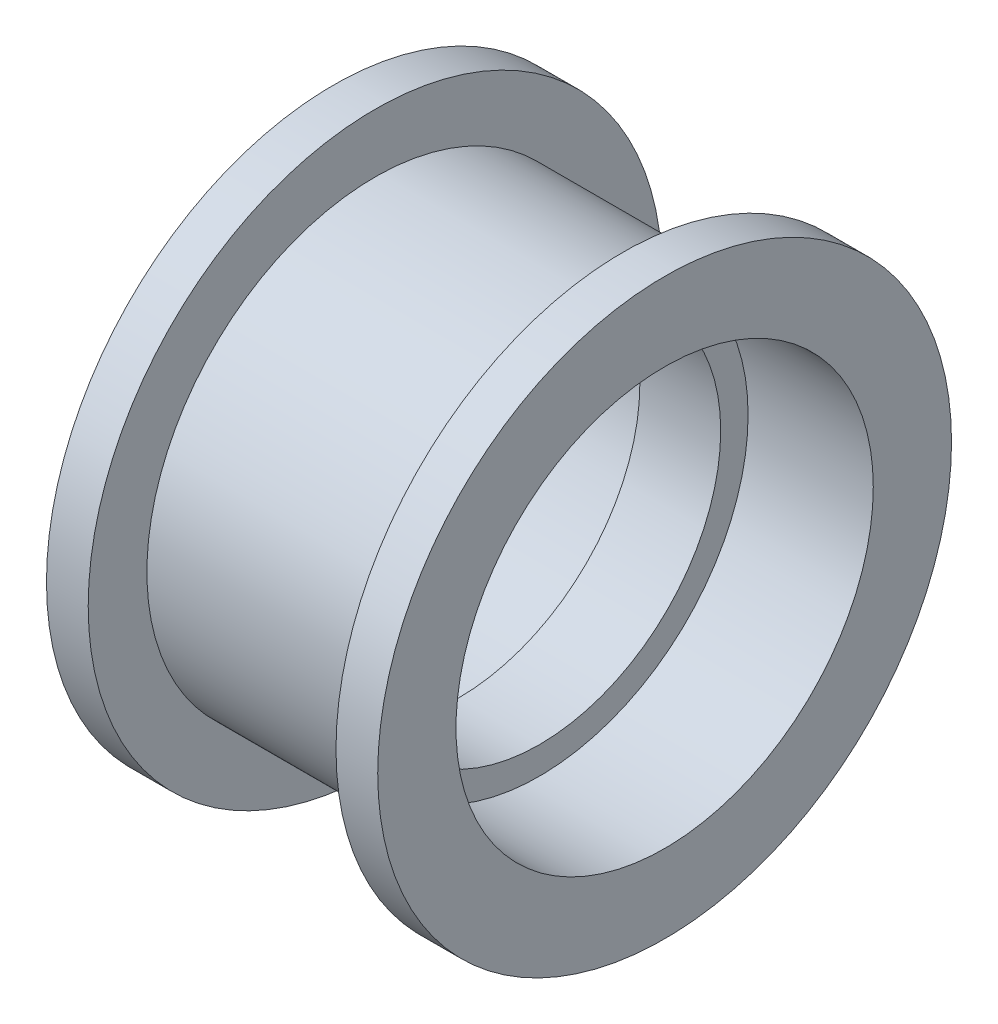
ISO-10303-21;
HEADER;
FILE_DESCRIPTION(('STEP AP214'),'2;1');
FILE_NAME('part.step','',(''),(''),'','','');
FILE_SCHEMA(('AUTOMOTIVE_DESIGN { 1 0 10303 214 1 1 1 1 }'));
ENDSEC;
DATA;
#1=APPLICATION_CONTEXT('core data for automotive mechanical design processes');
#2=APPLICATION_PROTOCOL_DEFINITION('international standard','automotive_design',2000,#1);
#3=PRODUCT_CONTEXT('',#1,'mechanical');
#4=PRODUCT('Part','Part','',(#3));
#5=PRODUCT_RELATED_PRODUCT_CATEGORY('part','',(#4));
#6=PRODUCT_DEFINITION_FORMATION('','',#4);
#7=PRODUCT_DEFINITION_CONTEXT('part definition',#1,'design');
#8=PRODUCT_DEFINITION('design','',#6,#7);
#9=PRODUCT_DEFINITION_SHAPE('','',#8);
#10=(LENGTH_UNIT() NAMED_UNIT(*) SI_UNIT(.MILLI.,.METRE.));
#11=(NAMED_UNIT(*) PLANE_ANGLE_UNIT() SI_UNIT($,.RADIAN.));
#12=(NAMED_UNIT(*) SI_UNIT($,.STERADIAN.) SOLID_ANGLE_UNIT());
#13=UNCERTAINTY_MEASURE_WITH_UNIT(LENGTH_MEASURE(1.E-05),#10,'distance_accuracy_value','');
#14=(GEOMETRIC_REPRESENTATION_CONTEXT(3) GLOBAL_UNCERTAINTY_ASSIGNED_CONTEXT((#13)) GLOBAL_UNIT_ASSIGNED_CONTEXT((#10,
#11,#12)) REPRESENTATION_CONTEXT('',''));
#15=CARTESIAN_POINT('',(0.,0.,0.));
#16=DIRECTION('',(0.,0.,1.));
#17=DIRECTION('',(1.,0.,0.));
#18=AXIS2_PLACEMENT_3D('',#15,#16,#17);
#19=CARTESIAN_POINT('',(-1.55,6.95,0.));
#20=DIRECTION('',(-1.,0.,0.));
#21=DIRECTION('',(0.,0.,1.));
#22=AXIS2_PLACEMENT_3D('',#19,#20,#21);
#23=PLANE('',#22);
#24=CARTESIAN_POINT('',(-1.55,0.,0.));
#25=DIRECTION('',(1.,0.,0.));
#26=DIRECTION('',(0.,0.,-1.));
#27=AXIS2_PLACEMENT_3D('',#24,#25,#26);
#28=CIRCLE('',#27,6.95);
#29=CARTESIAN_POINT('',(-1.55,0.,-6.95));
#30=VERTEX_POINT('',#29);
#31=EDGE_CURVE('E12',#30,#30,#28,.T.);
#32=ORIENTED_EDGE('',*,*,#31,.T.);
#33=EDGE_LOOP('',(#32));
#34=FACE_BOUND('',#33,.T.);
#35=CARTESIAN_POINT('',(-1.55,0.,0.));
#36=DIRECTION('',(1.,0.,0.));
#37=DIRECTION('',(0.,0.,-1.));
#38=AXIS2_PLACEMENT_3D('',#35,#36,#37);
#39=CIRCLE('',#38,8.);
#40=CARTESIAN_POINT('',(-1.55,0.,-8.));
#41=VERTEX_POINT('',#40);
#42=EDGE_CURVE('E87',#41,#41,#39,.T.);
#43=ORIENTED_EDGE('',*,*,#42,.F.);
#44=EDGE_LOOP('',(#43));
#45=FACE_BOUND('',#44,.T.);
#46=ADVANCED_FACE('F47',(#34,#45),#23,.T.);
#47=CARTESIAN_POINT('',(0.,0.,0.));
#48=DIRECTION('',(1.,0.,0.));
#49=DIRECTION('',(0.,0.,-1.));
#50=AXIS2_PLACEMENT_3D('',#47,#48,#49);
#51=CYLINDRICAL_SURFACE('',#50,6.95);
#52=CARTESIAN_POINT('',(1.55,0.,0.));
#53=DIRECTION('',(1.,0.,0.));
#54=DIRECTION('',(0.,0.,-1.));
#55=AXIS2_PLACEMENT_3D('',#52,#53,#54);
#56=CIRCLE('',#55,6.95);
#57=CARTESIAN_POINT('',(1.55,0.,-6.95));
#58=VERTEX_POINT('',#57);
#59=EDGE_CURVE('E53',#58,#58,#56,.T.);
#60=ORIENTED_EDGE('',*,*,#59,.T.);
#61=EDGE_LOOP('',(#60));
#62=FACE_BOUND('',#61,.T.);
#63=ORIENTED_EDGE('',*,*,#31,.F.);
#64=EDGE_LOOP('',(#63));
#65=FACE_BOUND('',#64,.T.);
#66=ADVANCED_FACE('F95',(#62,#65),#51,.F.);
#67=CARTESIAN_POINT('',(1.55,6.95,0.));
#68=DIRECTION('',(1.,0.,0.));
#69=DIRECTION('',(0.,0.,-1.));
#70=AXIS2_PLACEMENT_3D('',#67,#68,#69);
#71=PLANE('',#70);
#72=CARTESIAN_POINT('',(1.55,0.,0.));
#73=DIRECTION('',(1.,0.,0.));
#74=DIRECTION('',(0.,0.,-1.));
#75=AXIS2_PLACEMENT_3D('',#72,#73,#74);
#76=CIRCLE('',#75,8.);
#77=CARTESIAN_POINT('',(1.55,0.,-8.));
#78=VERTEX_POINT('',#77);
#79=EDGE_CURVE('E57',#78,#78,#76,.T.);
#80=ORIENTED_EDGE('',*,*,#79,.T.);
#81=EDGE_LOOP('',(#80));
#82=FACE_BOUND('',#81,.T.);
#83=ORIENTED_EDGE('',*,*,#59,.F.);
#84=EDGE_LOOP('',(#83));
#85=FACE_BOUND('',#84,.T.);
#86=ADVANCED_FACE('F99',(#82,#85),#71,.T.);
#87=CARTESIAN_POINT('',(0.,0.,0.));
#88=DIRECTION('',(1.,0.,0.));
#89=DIRECTION('',(0.,0.,-1.));
#90=AXIS2_PLACEMENT_3D('',#87,#88,#89);
#91=CYLINDRICAL_SURFACE('',#90,8.);
#92=CARTESIAN_POINT('',(6.35,0.,0.));
#93=DIRECTION('',(1.,0.,0.));
#94=DIRECTION('',(0.,0.,-1.));
#95=AXIS2_PLACEMENT_3D('',#92,#93,#94);
#96=CIRCLE('',#95,8.);
#97=CARTESIAN_POINT('',(6.35,0.,-8.));
#98=VERTEX_POINT('',#97);
#99=EDGE_CURVE('E61',#98,#98,#96,.T.);
#100=ORIENTED_EDGE('',*,*,#99,.T.);
#101=EDGE_LOOP('',(#100));
#102=FACE_BOUND('',#101,.T.);
#103=ORIENTED_EDGE('',*,*,#79,.F.);
#104=EDGE_LOOP('',(#103));
#105=FACE_BOUND('',#104,.T.);
#106=ADVANCED_FACE('F103',(#102,#105),#91,.F.);
#107=CARTESIAN_POINT('',(6.35,8.,0.));
#108=DIRECTION('',(1.,0.,0.));
#109=DIRECTION('',(0.,0.,-1.));
#110=AXIS2_PLACEMENT_3D('',#107,#108,#109);
#111=PLANE('',#110);
#112=CARTESIAN_POINT('',(6.35,0.,0.));
#113=DIRECTION('',(1.,0.,0.));
#114=DIRECTION('',(0.,0.,-1.));
#115=AXIS2_PLACEMENT_3D('',#112,#113,#114);
#116=CIRCLE('',#115,11.);
#117=CARTESIAN_POINT('',(6.35,0.,-11.));
#118=VERTEX_POINT('',#117);
#119=EDGE_CURVE('E66',#118,#118,#116,.T.);
#120=ORIENTED_EDGE('',*,*,#119,.T.);
#121=EDGE_LOOP('',(#120));
#122=FACE_BOUND('',#121,.T.);
#123=ORIENTED_EDGE('',*,*,#99,.F.);
#124=EDGE_LOOP('',(#123));
#125=FACE_BOUND('',#124,.T.);
#126=ADVANCED_FACE('F110',(#122,#125),#111,.T.);
#127=CARTESIAN_POINT('',(0.,0.,0.));
#128=DIRECTION('',(1.,0.,0.));
#129=DIRECTION('',(0.,0.,-1.));
#130=AXIS2_PLACEMENT_3D('',#127,#128,#129);
#131=CYLINDRICAL_SURFACE('',#130,11.);
#132=CARTESIAN_POINT('',(4.75,0.,0.));
#133=DIRECTION('',(1.,0.,0.));
#134=DIRECTION('',(0.,0.,-1.));
#135=AXIS2_PLACEMENT_3D('',#132,#133,#134);
#136=CIRCLE('',#135,11.);
#137=CARTESIAN_POINT('',(4.75,0.,-11.));
#138=VERTEX_POINT('',#137);
#139=EDGE_CURVE('E69',#138,#138,#136,.T.);
#140=ORIENTED_EDGE('',*,*,#139,.T.);
#141=EDGE_LOOP('',(#140));
#142=FACE_BOUND('',#141,.T.);
#143=ORIENTED_EDGE('',*,*,#119,.F.);
#144=EDGE_LOOP('',(#143));
#145=FACE_BOUND('',#144,.T.);
#146=ADVANCED_FACE('F114',(#142,#145),#131,.T.);
#147=CARTESIAN_POINT('',(4.75,11.,0.));
#148=DIRECTION('',(-1.,0.,0.));
#149=DIRECTION('',(0.,0.,1.));
#150=AXIS2_PLACEMENT_3D('',#147,#148,#149);
#151=PLANE('',#150);
#152=CARTESIAN_POINT('',(4.75,0.,0.));
#153=DIRECTION('',(1.,0.,0.));
#154=DIRECTION('',(0.,0.,-1.));
#155=AXIS2_PLACEMENT_3D('',#152,#153,#154);
#156=CIRCLE('',#155,8.75);
#157=CARTESIAN_POINT('',(4.75,0.,-8.75));
#158=VERTEX_POINT('',#157);
#159=EDGE_CURVE('E72',#158,#158,#156,.T.);
#160=ORIENTED_EDGE('',*,*,#159,.T.);
#161=EDGE_LOOP('',(#160));
#162=FACE_BOUND('',#161,.T.);
#163=ORIENTED_EDGE('',*,*,#139,.F.);
#164=EDGE_LOOP('',(#163));
#165=FACE_BOUND('',#164,.T.);
#166=ADVANCED_FACE('F118',(#162,#165),#151,.T.);
#167=CARTESIAN_POINT('',(0.,0.,0.));
#168=DIRECTION('',(1.,0.,0.));
#169=DIRECTION('',(0.,0.,-1.));
#170=AXIS2_PLACEMENT_3D('',#167,#168,#169);
#171=CYLINDRICAL_SURFACE('',#170,8.75);
#172=CARTESIAN_POINT('',(-4.75,0.,0.));
#173=DIRECTION('',(1.,0.,0.));
#174=DIRECTION('',(0.,0.,-1.));
#175=AXIS2_PLACEMENT_3D('',#172,#173,#174);
#176=CIRCLE('',#175,8.75);
#177=CARTESIAN_POINT('',(-4.75,0.,-8.75));
#178=VERTEX_POINT('',#177);
#179=EDGE_CURVE('E75',#178,#178,#176,.T.);
#180=ORIENTED_EDGE('',*,*,#179,.T.);
#181=EDGE_LOOP('',(#180));
#182=FACE_BOUND('',#181,.T.);
#183=ORIENTED_EDGE('',*,*,#159,.F.);
#184=EDGE_LOOP('',(#183));
#185=FACE_BOUND('',#184,.T.);
#186=ADVANCED_FACE('F122',(#182,#185),#171,.T.);
#187=CARTESIAN_POINT('',(-4.75,11.,0.));
#188=DIRECTION('',(1.,0.,0.));
#189=DIRECTION('',(0.,0.,-1.));
#190=AXIS2_PLACEMENT_3D('',#187,#188,#189);
#191=PLANE('',#190);
#192=CARTESIAN_POINT('',(-4.75,0.,0.));
#193=DIRECTION('',(1.,0.,0.));
#194=DIRECTION('',(0.,0.,-1.));
#195=AXIS2_PLACEMENT_3D('',#192,#193,#194);
#196=CIRCLE('',#195,11.);
#197=CARTESIAN_POINT('',(-4.75,0.,-11.));
#198=VERTEX_POINT('',#197);
#199=EDGE_CURVE('E78',#198,#198,#196,.T.);
#200=ORIENTED_EDGE('',*,*,#199,.T.);
#201=EDGE_LOOP('',(#200));
#202=FACE_BOUND('',#201,.T.);
#203=ORIENTED_EDGE('',*,*,#179,.F.);
#204=EDGE_LOOP('',(#203));
#205=FACE_BOUND('',#204,.T.);
#206=ADVANCED_FACE('F126',(#202,#205),#191,.T.);
#207=CARTESIAN_POINT('',(0.,0.,0.));
#208=DIRECTION('',(1.,0.,0.));
#209=DIRECTION('',(0.,0.,-1.));
#210=AXIS2_PLACEMENT_3D('',#207,#208,#209);
#211=CYLINDRICAL_SURFACE('',#210,11.);
#212=CARTESIAN_POINT('',(-6.35,0.,0.));
#213=DIRECTION('',(1.,0.,0.));
#214=DIRECTION('',(0.,0.,-1.));
#215=AXIS2_PLACEMENT_3D('',#212,#213,#214);
#216=CIRCLE('',#215,11.);
#217=CARTESIAN_POINT('',(-6.35,0.,-11.));
#218=VERTEX_POINT('',#217);
#219=EDGE_CURVE('E81',#218,#218,#216,.T.);
#220=ORIENTED_EDGE('',*,*,#219,.T.);
#221=EDGE_LOOP('',(#220));
#222=FACE_BOUND('',#221,.T.);
#223=ORIENTED_EDGE('',*,*,#199,.F.);
#224=EDGE_LOOP('',(#223));
#225=FACE_BOUND('',#224,.T.);
#226=ADVANCED_FACE('F130',(#222,#225),#211,.T.);
#227=CARTESIAN_POINT('',(-6.35,8.,0.));
#228=DIRECTION('',(-1.,0.,0.));
#229=DIRECTION('',(0.,0.,1.));
#230=AXIS2_PLACEMENT_3D('',#227,#228,#229);
#231=PLANE('',#230);
#232=CARTESIAN_POINT('',(-6.35,0.,0.));
#233=DIRECTION('',(1.,0.,0.));
#234=DIRECTION('',(0.,0.,-1.));
#235=AXIS2_PLACEMENT_3D('',#232,#233,#234);
#236=CIRCLE('',#235,8.);
#237=CARTESIAN_POINT('',(-6.35,0.,-8.));
#238=VERTEX_POINT('',#237);
#239=EDGE_CURVE('E84',#238,#238,#236,.T.);
#240=ORIENTED_EDGE('',*,*,#239,.T.);
#241=EDGE_LOOP('',(#240));
#242=FACE_BOUND('',#241,.T.);
#243=ORIENTED_EDGE('',*,*,#219,.F.);
#244=EDGE_LOOP('',(#243));
#245=FACE_BOUND('',#244,.T.);
#246=ADVANCED_FACE('F134',(#242,#245),#231,.T.);
#247=CARTESIAN_POINT('',(0.,0.,0.));
#248=DIRECTION('',(1.,0.,0.));
#249=DIRECTION('',(0.,0.,-1.));
#250=AXIS2_PLACEMENT_3D('',#247,#248,#249);
#251=CYLINDRICAL_SURFACE('',#250,8.);
#252=ORIENTED_EDGE('',*,*,#42,.T.);
#253=EDGE_LOOP('',(#252));
#254=FACE_BOUND('',#253,.T.);
#255=ORIENTED_EDGE('',*,*,#239,.F.);
#256=EDGE_LOOP('',(#255));
#257=FACE_BOUND('',#256,.T.);
#258=ADVANCED_FACE('F91',(#254,#257),#251,.F.);
#259=CLOSED_SHELL('',(#46,#66,#86,#106,#126,#146,#166,#186,#206,#226,#246,#258));
#260=MANIFOLD_SOLID_BREP('B2',#259);
#261=ADVANCED_BREP_SHAPE_REPRESENTATION('',(#18,#260),#14);
#262=SHAPE_DEFINITION_REPRESENTATION(#9,#261);
ENDSEC;
END-ISO-10303-21;
